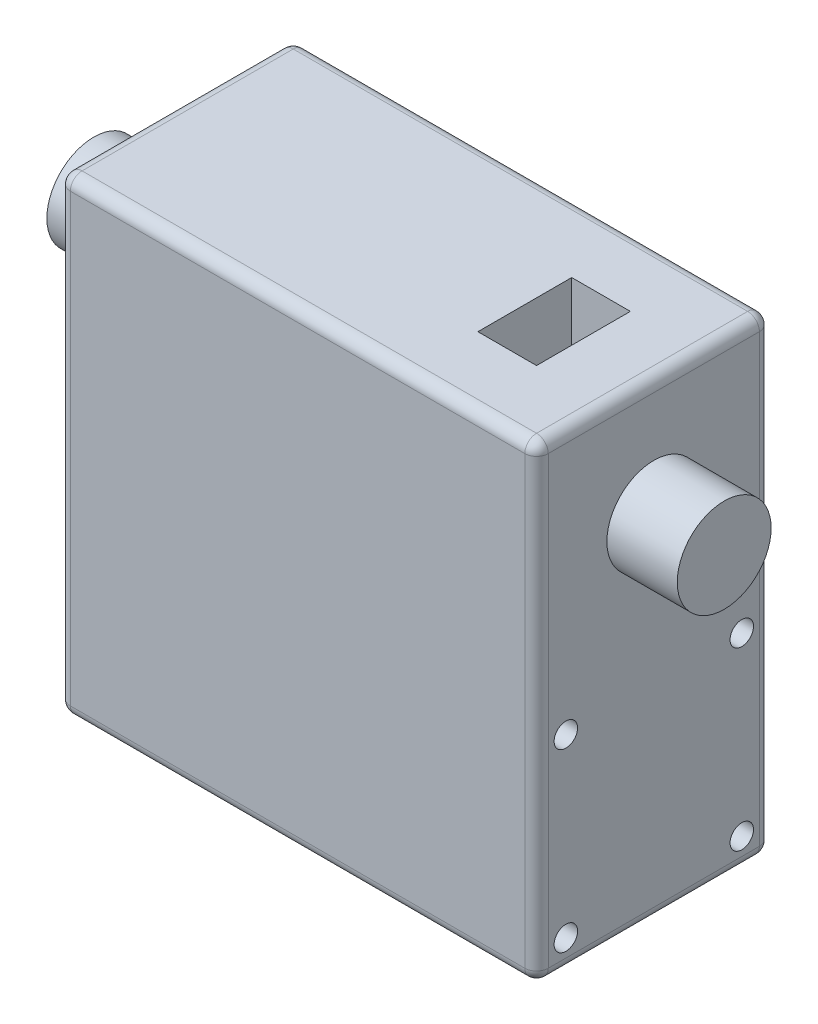
ISO-10303-21;
HEADER;
FILE_DESCRIPTION(('STEP AP214'),'2;1');
FILE_NAME('part.step','',(''),(''),'','','');
FILE_SCHEMA(('AUTOMOTIVE_DESIGN { 1 0 10303 214 1 1 1 1 }'));
ENDSEC;
DATA;
#1=APPLICATION_CONTEXT('core data for automotive mechanical design processes');
#2=APPLICATION_PROTOCOL_DEFINITION('international standard','automotive_design',2000,#1);
#3=PRODUCT_CONTEXT('',#1,'mechanical');
#4=PRODUCT('Part','Part','',(#3));
#5=PRODUCT_RELATED_PRODUCT_CATEGORY('part','',(#4));
#6=PRODUCT_DEFINITION_FORMATION('','',#4);
#7=PRODUCT_DEFINITION_CONTEXT('part definition',#1,'design');
#8=PRODUCT_DEFINITION('design','',#6,#7);
#9=PRODUCT_DEFINITION_SHAPE('','',#8);
#10=(LENGTH_UNIT() NAMED_UNIT(*) SI_UNIT(.MILLI.,.METRE.));
#11=(NAMED_UNIT(*) PLANE_ANGLE_UNIT() SI_UNIT($,.RADIAN.));
#12=(NAMED_UNIT(*) SI_UNIT($,.STERADIAN.) SOLID_ANGLE_UNIT());
#13=UNCERTAINTY_MEASURE_WITH_UNIT(LENGTH_MEASURE(1.E-05),#10,'distance_accuracy_value','');
#14=(GEOMETRIC_REPRESENTATION_CONTEXT(3) GLOBAL_UNCERTAINTY_ASSIGNED_CONTEXT((#13)) GLOBAL_UNIT_ASSIGNED_CONTEXT((#10,
#11,#12)) REPRESENTATION_CONTEXT('',''));
#15=CARTESIAN_POINT('',(0.,0.,0.));
#16=DIRECTION('',(0.,0.,1.));
#17=DIRECTION('',(1.,0.,0.));
#18=AXIS2_PLACEMENT_3D('',#15,#16,#17);
#19=CARTESIAN_POINT('',(0.,0.,20.));
#20=DIRECTION('',(1.,0.,0.));
#21=DIRECTION('',(0.,0.,-1.));
#22=AXIS2_PLACEMENT_3D('',#19,#20,#21);
#23=PLANE('',#22);
#24=CARTESIAN_POINT('',(0.,10.,17.));
#25=DIRECTION('',(-1.,0.,0.));
#26=DIRECTION('',(0.,0.,1.));
#27=AXIS2_PLACEMENT_3D('',#24,#25,#26);
#28=CIRCLE('',#27,1.);
#29=CARTESIAN_POINT('',(0.,10.,18.));
#30=VERTEX_POINT('',#29);
#31=EDGE_CURVE('E839',#30,#30,#28,.T.);
#32=ORIENTED_EDGE('',*,*,#31,.F.);
#33=EDGE_LOOP('',(#32));
#34=FACE_BOUND('',#33,.T.);
#35=CARTESIAN_POINT('',(0.,3.,10.));
#36=DIRECTION('',(-1.,0.,0.));
#37=DIRECTION('',(0.,0.,1.));
#38=AXIS2_PLACEMENT_3D('',#35,#36,#37);
#39=CIRCLE('',#38,1.);
#40=CARTESIAN_POINT('',(0.,3.,11.));
#41=VERTEX_POINT('',#40);
#42=EDGE_CURVE('E850',#41,#41,#39,.T.);
#43=ORIENTED_EDGE('',*,*,#42,.F.);
#44=EDGE_LOOP('',(#43));
#45=FACE_BOUND('',#44,.T.);
#46=CARTESIAN_POINT('',(0.,10.,3.));
#47=DIRECTION('',(-1.,0.,0.));
#48=DIRECTION('',(0.,0.,1.));
#49=AXIS2_PLACEMENT_3D('',#46,#47,#48);
#50=CIRCLE('',#49,1.);
#51=CARTESIAN_POINT('',(0.,10.,4.));
#52=VERTEX_POINT('',#51);
#53=EDGE_CURVE('E856',#52,#52,#50,.T.);
#54=ORIENTED_EDGE('',*,*,#53,.F.);
#55=EDGE_LOOP('',(#54));
#56=FACE_BOUND('',#55,.T.);
#57=CARTESIAN_POINT('',(0.,30.,10.));
#58=DIRECTION('',(1.,0.,0.));
#59=DIRECTION('',(0.,0.,-1.));
#60=AXIS2_PLACEMENT_3D('',#57,#58,#59);
#61=CIRCLE('',#60,4.);
#62=CARTESIAN_POINT('',(0.,30.,6.));
#63=VERTEX_POINT('',#62);
#64=EDGE_CURVE('E11',#63,#63,#61,.F.);
#65=ORIENTED_EDGE('',*,*,#64,.F.);
#66=EDGE_LOOP('',(#65));
#67=FACE_BOUND('',#66,.T.);
#68=DIRECTION('',(0.,0.,-1.));
#69=VECTOR('',#68,1.);
#70=CARTESIAN_POINT('',(0.,39.,20.));
#71=LINE('',#70,#69);
#72=CARTESIAN_POINT('',(0.,39.,19.));
#73=VERTEX_POINT('',#72);
#74=CARTESIAN_POINT('',(0.,39.,1.));
#75=VERTEX_POINT('',#74);
#76=EDGE_CURVE('E221',#73,#75,#71,.T.);
#77=ORIENTED_EDGE('',*,*,#76,.T.);
#78=DIRECTION('',(0.,-1.,0.));
#79=VECTOR('',#78,1.);
#80=CARTESIAN_POINT('',(0.,0.,1.));
#81=LINE('',#80,#79);
#82=CARTESIAN_POINT('',(0.,1.,1.));
#83=VERTEX_POINT('',#82);
#84=EDGE_CURVE('E226',#75,#83,#81,.T.);
#85=ORIENTED_EDGE('',*,*,#84,.T.);
#86=DIRECTION('',(0.,0.,-1.));
#87=VECTOR('',#86,1.);
#88=CARTESIAN_POINT('',(0.,1.,20.));
#89=LINE('',#88,#87);
#90=CARTESIAN_POINT('',(0.,1.,19.));
#91=VERTEX_POINT('',#90);
#92=EDGE_CURVE('E223',#83,#91,#89,.F.);
#93=ORIENTED_EDGE('',*,*,#92,.T.);
#94=DIRECTION('',(0.,-1.,0.));
#95=VECTOR('',#94,1.);
#96=CARTESIAN_POINT('',(0.,0.,19.));
#97=LINE('',#96,#95);
#98=EDGE_CURVE('E219',#91,#73,#97,.F.);
#99=ORIENTED_EDGE('',*,*,#98,.T.);
#100=EDGE_LOOP('',(#77,#85,#93,#99));
#101=FACE_BOUND('',#100,.T.);
#102=ADVANCED_FACE('F32',(#34,#45,#56,#67,#101),#23,.F.);
#103=CARTESIAN_POINT('',(0.,0.,20.));
#104=DIRECTION('',(0.,1.,0.));
#105=DIRECTION('',(0.,0.,1.));
#106=AXIS2_PLACEMENT_3D('',#103,#104,#105);
#107=PLANE('',#106);
#108=DIRECTION('',(0.,0.,-1.));
#109=VECTOR('',#108,1.);
#110=CARTESIAN_POINT('',(1.,0.,20.));
#111=LINE('',#110,#109);
#112=CARTESIAN_POINT('',(1.,0.,19.));
#113=VERTEX_POINT('',#112);
#114=CARTESIAN_POINT('',(1.,0.,1.));
#115=VERTEX_POINT('',#114);
#116=EDGE_CURVE('E203',#113,#115,#111,.T.);
#117=ORIENTED_EDGE('',*,*,#116,.T.);
#118=DIRECTION('',(1.,0.,0.));
#119=VECTOR('',#118,1.);
#120=CARTESIAN_POINT('',(40.745918,0.,1.));
#121=LINE('',#120,#119);
#122=CARTESIAN_POINT('',(39.745918,0.,1.));
#123=VERTEX_POINT('',#122);
#124=EDGE_CURVE('E208',#115,#123,#121,.T.);
#125=ORIENTED_EDGE('',*,*,#124,.T.);
#126=DIRECTION('',(0.,0.,-1.));
#127=VECTOR('',#126,1.);
#128=CARTESIAN_POINT('',(39.745918,0.,20.));
#129=LINE('',#128,#127);
#130=CARTESIAN_POINT('',(39.745918,0.,19.));
#131=VERTEX_POINT('',#130);
#132=EDGE_CURVE('E205',#123,#131,#129,.F.);
#133=ORIENTED_EDGE('',*,*,#132,.T.);
#134=DIRECTION('',(1.,0.,0.));
#135=VECTOR('',#134,1.);
#136=CARTESIAN_POINT('',(0.,0.,19.));
#137=LINE('',#136,#135);
#138=EDGE_CURVE('E201',#131,#113,#137,.F.);
#139=ORIENTED_EDGE('',*,*,#138,.T.);
#140=EDGE_LOOP('',(#117,#125,#133,#139));
#141=FACE_BOUND('',#140,.T.);
#142=ADVANCED_FACE('F316',(#141),#107,.F.);
#143=CARTESIAN_POINT('',(40.745918,0.,20.));
#144=DIRECTION('',(-1.,0.,0.));
#145=DIRECTION('',(0.,0.,1.));
#146=AXIS2_PLACEMENT_3D('',#143,#144,#145);
#147=PLANE('',#146);
#148=CARTESIAN_POINT('',(40.745918,2.5,17.5));
#149=DIRECTION('',(1.,0.,0.));
#150=DIRECTION('',(0.,0.,-1.));
#151=AXIS2_PLACEMENT_3D('',#148,#149,#150);
#152=CIRCLE('',#151,1.);
#153=CARTESIAN_POINT('',(40.745918,2.5,16.5));
#154=VERTEX_POINT('',#153);
#155=EDGE_CURVE('E838',#154,#154,#152,.T.);
#156=ORIENTED_EDGE('',*,*,#155,.F.);
#157=EDGE_LOOP('',(#156));
#158=FACE_BOUND('',#157,.T.);
#159=CARTESIAN_POINT('',(40.745918,2.5,2.5));
#160=DIRECTION('',(1.,0.,0.));
#161=DIRECTION('',(0.,0.,-1.));
#162=AXIS2_PLACEMENT_3D('',#159,#160,#161);
#163=CIRCLE('',#162,1.);
#164=CARTESIAN_POINT('',(40.745918,2.5,1.5));
#165=VERTEX_POINT('',#164);
#166=EDGE_CURVE('E869',#165,#165,#163,.T.);
#167=ORIENTED_EDGE('',*,*,#166,.F.);
#168=EDGE_LOOP('',(#167));
#169=FACE_BOUND('',#168,.T.);
#170=CARTESIAN_POINT('',(40.745918,17.5,2.5));
#171=DIRECTION('',(1.,0.,0.));
#172=DIRECTION('',(0.,0.,-1.));
#173=AXIS2_PLACEMENT_3D('',#170,#171,#172);
#174=CIRCLE('',#173,1.);
#175=CARTESIAN_POINT('',(40.745918,17.5,1.5));
#176=VERTEX_POINT('',#175);
#177=EDGE_CURVE('E863',#176,#176,#174,.T.);
#178=ORIENTED_EDGE('',*,*,#177,.F.);
#179=EDGE_LOOP('',(#178));
#180=FACE_BOUND('',#179,.T.);
#181=CARTESIAN_POINT('',(40.745918,17.5,17.5));
#182=DIRECTION('',(1.,0.,0.));
#183=DIRECTION('',(0.,0.,-1.));
#184=AXIS2_PLACEMENT_3D('',#181,#182,#183);
#185=CIRCLE('',#184,1.);
#186=CARTESIAN_POINT('',(40.745918,17.5,16.5));
#187=VERTEX_POINT('',#186);
#188=EDGE_CURVE('E862',#187,#187,#185,.T.);
#189=ORIENTED_EDGE('',*,*,#188,.F.);
#190=EDGE_LOOP('',(#189));
#191=FACE_BOUND('',#190,.T.);
#192=CARTESIAN_POINT('',(40.745918,30.,10.));
#193=DIRECTION('',(-1.,0.,0.));
#194=DIRECTION('',(0.,0.,1.));
#195=AXIS2_PLACEMENT_3D('',#192,#193,#194);
#196=CIRCLE('',#195,4.);
#197=CARTESIAN_POINT('',(40.745918,30.,14.));
#198=VERTEX_POINT('',#197);
#199=EDGE_CURVE('E40',#198,#198,#196,.F.);
#200=ORIENTED_EDGE('',*,*,#199,.F.);
#201=EDGE_LOOP('',(#200));
#202=FACE_BOUND('',#201,.T.);
#203=DIRECTION('',(0.,0.,-1.));
#204=VECTOR('',#203,1.);
#205=CARTESIAN_POINT('',(40.745918,1.,20.));
#206=LINE('',#205,#204);
#207=CARTESIAN_POINT('',(40.745918,1.,19.));
#208=VERTEX_POINT('',#207);
#209=CARTESIAN_POINT('',(40.745918,1.,1.));
#210=VERTEX_POINT('',#209);
#211=EDGE_CURVE('E196',#208,#210,#206,.T.);
#212=ORIENTED_EDGE('',*,*,#211,.T.);
#213=DIRECTION('',(0.,1.,0.));
#214=VECTOR('',#213,1.);
#215=CARTESIAN_POINT('',(40.745918,40.,1.));
#216=LINE('',#215,#214);
#217=CARTESIAN_POINT('',(40.745918,39.,1.));
#218=VERTEX_POINT('',#217);
#219=EDGE_CURVE('E199',#210,#218,#216,.T.);
#220=ORIENTED_EDGE('',*,*,#219,.T.);
#221=DIRECTION('',(0.,0.,-1.));
#222=VECTOR('',#221,1.);
#223=CARTESIAN_POINT('',(40.745918,39.,20.));
#224=LINE('',#223,#222);
#225=CARTESIAN_POINT('',(40.745918,39.,19.));
#226=VERTEX_POINT('',#225);
#227=EDGE_CURVE('E193',#218,#226,#224,.F.);
#228=ORIENTED_EDGE('',*,*,#227,.T.);
#229=DIRECTION('',(0.,1.,0.));
#230=VECTOR('',#229,1.);
#231=CARTESIAN_POINT('',(40.745918,0.,19.));
#232=LINE('',#231,#230);
#233=EDGE_CURVE('E191',#226,#208,#232,.F.);
#234=ORIENTED_EDGE('',*,*,#233,.T.);
#235=EDGE_LOOP('',(#212,#220,#228,#234));
#236=FACE_BOUND('',#235,.T.);
#237=ADVANCED_FACE('F312',(#158,#169,#180,#191,#202,#236),#147,.F.);
#238=CARTESIAN_POINT('',(0.,40.,20.));
#239=DIRECTION('',(0.,-1.,0.));
#240=DIRECTION('',(0.,0.,-1.));
#241=AXIS2_PLACEMENT_3D('',#238,#239,#240);
#242=PLANE('',#241);
#243=DIRECTION('',(1.,0.,0.));
#244=VECTOR('',#243,1.);
#245=CARTESIAN_POINT('',(29.745918,40.,14.));
#246=LINE('',#245,#244);
#247=CARTESIAN_POINT('',(29.745918,40.,14.));
#248=VERTEX_POINT('',#247);
#249=CARTESIAN_POINT('',(34.745918,40.,14.));
#250=VERTEX_POINT('',#249);
#251=EDGE_CURVE('E178',#248,#250,#246,.T.);
#252=ORIENTED_EDGE('',*,*,#251,.F.);
#253=DIRECTION('',(0.,0.,1.));
#254=VECTOR('',#253,1.);
#255=CARTESIAN_POINT('',(29.745918,40.,6.));
#256=LINE('',#255,#254);
#257=CARTESIAN_POINT('',(29.745918,40.,6.));
#258=VERTEX_POINT('',#257);
#259=EDGE_CURVE('E47',#258,#248,#256,.T.);
#260=ORIENTED_EDGE('',*,*,#259,.F.);
#261=DIRECTION('',(-1.,0.,0.));
#262=VECTOR('',#261,1.);
#263=CARTESIAN_POINT('',(29.745918,40.,6.));
#264=LINE('',#263,#262);
#265=CARTESIAN_POINT('',(34.745918,40.,6.));
#266=VERTEX_POINT('',#265);
#267=EDGE_CURVE('E166',#266,#258,#264,.T.);
#268=ORIENTED_EDGE('',*,*,#267,.F.);
#269=DIRECTION('',(0.,0.,-1.));
#270=VECTOR('',#269,1.);
#271=CARTESIAN_POINT('',(34.745918,40.,6.));
#272=LINE('',#271,#270);
#273=EDGE_CURVE('E169',#250,#266,#272,.T.);
#274=ORIENTED_EDGE('',*,*,#273,.F.);
#275=EDGE_LOOP('',(#252,#260,#268,#274));
#276=FACE_BOUND('',#275,.T.);
#277=DIRECTION('',(0.,0.,-1.));
#278=VECTOR('',#277,1.);
#279=CARTESIAN_POINT('',(39.745918,40.,20.));
#280=LINE('',#279,#278);
#281=CARTESIAN_POINT('',(39.745918,40.,19.));
#282=VERTEX_POINT('',#281);
#283=CARTESIAN_POINT('',(39.745918,40.,1.));
#284=VERTEX_POINT('',#283);
#285=EDGE_CURVE('E214',#282,#284,#280,.T.);
#286=ORIENTED_EDGE('',*,*,#285,.T.);
#287=DIRECTION('',(-1.,0.,0.));
#288=VECTOR('',#287,1.);
#289=CARTESIAN_POINT('',(0.,40.,1.));
#290=LINE('',#289,#288);
#291=CARTESIAN_POINT('',(1.,40.,1.));
#292=VERTEX_POINT('',#291);
#293=EDGE_CURVE('E217',#284,#292,#290,.T.);
#294=ORIENTED_EDGE('',*,*,#293,.T.);
#295=DIRECTION('',(0.,0.,-1.));
#296=VECTOR('',#295,1.);
#297=CARTESIAN_POINT('',(1.,40.,20.));
#298=LINE('',#297,#296);
#299=CARTESIAN_POINT('',(1.,40.,19.));
#300=VERTEX_POINT('',#299);
#301=EDGE_CURVE('E212',#292,#300,#298,.F.);
#302=ORIENTED_EDGE('',*,*,#301,.T.);
#303=DIRECTION('',(-1.,0.,0.));
#304=VECTOR('',#303,1.);
#305=CARTESIAN_POINT('',(0.,40.,19.));
#306=LINE('',#305,#304);
#307=EDGE_CURVE('E210',#300,#282,#306,.F.);
#308=ORIENTED_EDGE('',*,*,#307,.T.);
#309=EDGE_LOOP('',(#286,#294,#302,#308));
#310=FACE_BOUND('',#309,.T.);
#311=ADVANCED_FACE('F315',(#276,#310),#242,.F.);
#312=CARTESIAN_POINT('',(0.,0.,20.));
#313=DIRECTION('',(0.,0.,-1.));
#314=DIRECTION('',(-1.,0.,0.));
#315=AXIS2_PLACEMENT_3D('',#312,#313,#314);
#316=PLANE('',#315);
#317=DIRECTION('',(-1.,0.,0.));
#318=VECTOR('',#317,1.);
#319=CARTESIAN_POINT('',(0.,39.,20.));
#320=LINE('',#319,#318);
#321=CARTESIAN_POINT('',(39.745918,39.,20.));
#322=VERTEX_POINT('',#321);
#323=CARTESIAN_POINT('',(1.,39.,20.));
#324=VERTEX_POINT('',#323);
#325=EDGE_CURVE('E239',#322,#324,#320,.T.);
#326=ORIENTED_EDGE('',*,*,#325,.T.);
#327=DIRECTION('',(0.,-1.,0.));
#328=VECTOR('',#327,1.);
#329=CARTESIAN_POINT('',(1.,0.,20.));
#330=LINE('',#329,#328);
#331=CARTESIAN_POINT('',(1.,1.,20.));
#332=VERTEX_POINT('',#331);
#333=EDGE_CURVE('E55',#324,#332,#330,.T.);
#334=ORIENTED_EDGE('',*,*,#333,.T.);
#335=DIRECTION('',(1.,0.,0.));
#336=VECTOR('',#335,1.);
#337=CARTESIAN_POINT('',(0.,1.,20.));
#338=LINE('',#337,#336);
#339=CARTESIAN_POINT('',(39.745918,1.,20.));
#340=VERTEX_POINT('',#339);
#341=EDGE_CURVE('E241',#332,#340,#338,.T.);
#342=ORIENTED_EDGE('',*,*,#341,.T.);
#343=DIRECTION('',(0.,1.,0.));
#344=VECTOR('',#343,1.);
#345=CARTESIAN_POINT('',(39.745918,0.,20.));
#346=LINE('',#345,#344);
#347=EDGE_CURVE('E237',#340,#322,#346,.T.);
#348=ORIENTED_EDGE('',*,*,#347,.T.);
#349=EDGE_LOOP('',(#326,#334,#342,#348));
#350=FACE_BOUND('',#349,.T.);
#351=ADVANCED_FACE('F403',(#350),#316,.F.);
#352=CARTESIAN_POINT('',(0.,0.,0.));
#353=DIRECTION('',(0.,0.,-1.));
#354=DIRECTION('',(-1.,0.,0.));
#355=AXIS2_PLACEMENT_3D('',#352,#353,#354);
#356=PLANE('',#355);
#357=DIRECTION('',(1.,0.,0.));
#358=VECTOR('',#357,1.);
#359=CARTESIAN_POINT('',(0.,1.,0.));
#360=LINE('',#359,#358);
#361=CARTESIAN_POINT('',(39.745918,1.,0.));
#362=VERTEX_POINT('',#361);
#363=CARTESIAN_POINT('',(1.,1.,0.));
#364=VERTEX_POINT('',#363);
#365=EDGE_CURVE('E232',#362,#364,#360,.F.);
#366=ORIENTED_EDGE('',*,*,#365,.T.);
#367=DIRECTION('',(0.,-1.,0.));
#368=VECTOR('',#367,1.);
#369=CARTESIAN_POINT('',(1.,40.,0.));
#370=LINE('',#369,#368);
#371=CARTESIAN_POINT('',(1.,39.,0.));
#372=VERTEX_POINT('',#371);
#373=EDGE_CURVE('E235',#364,#372,#370,.F.);
#374=ORIENTED_EDGE('',*,*,#373,.T.);
#375=DIRECTION('',(-1.,0.,0.));
#376=VECTOR('',#375,1.);
#377=CARTESIAN_POINT('',(40.745918,39.,0.));
#378=LINE('',#377,#376);
#379=CARTESIAN_POINT('',(39.745918,39.,0.));
#380=VERTEX_POINT('',#379);
#381=EDGE_CURVE('E230',#372,#380,#378,.F.);
#382=ORIENTED_EDGE('',*,*,#381,.T.);
#383=DIRECTION('',(0.,1.,0.));
#384=VECTOR('',#383,1.);
#385=CARTESIAN_POINT('',(39.745918,0.,0.));
#386=LINE('',#385,#384);
#387=EDGE_CURVE('E228',#380,#362,#386,.F.);
#388=ORIENTED_EDGE('',*,*,#387,.T.);
#389=EDGE_LOOP('',(#366,#374,#382,#388));
#390=FACE_BOUND('',#389,.T.);
#391=ADVANCED_FACE('F383',(#390),#356,.T.);
#392=CARTESIAN_POINT('',(1.,39.,20.));
#393=DIRECTION('',(0.,0.,-1.));
#394=DIRECTION('',(-1.,0.,0.));
#395=AXIS2_PLACEMENT_3D('',#392,#393,#394);
#396=CYLINDRICAL_SURFACE('',#395,1.);
#397=CARTESIAN_POINT('',(1.,39.,19.));
#398=DIRECTION('',(0.,0.,1.));
#399=DIRECTION('',(1.,0.,0.));
#400=AXIS2_PLACEMENT_3D('',#397,#398,#399);
#401=CIRCLE('',#400,1.);
#402=EDGE_CURVE('E194',#300,#73,#401,.T.);
#403=ORIENTED_EDGE('',*,*,#402,.F.);
#404=ORIENTED_EDGE('',*,*,#301,.F.);
#405=CARTESIAN_POINT('',(1.,39.,1.));
#406=DIRECTION('',(0.,0.,-1.));
#407=DIRECTION('',(-1.,0.,0.));
#408=AXIS2_PLACEMENT_3D('',#405,#406,#407);
#409=CIRCLE('',#408,1.);
#410=EDGE_CURVE('E303',#75,#292,#409,.T.);
#411=ORIENTED_EDGE('',*,*,#410,.F.);
#412=ORIENTED_EDGE('',*,*,#76,.F.);
#413=EDGE_LOOP('',(#403,#404,#411,#412));
#414=FACE_BOUND('',#413,.T.);
#415=ADVANCED_FACE('F34',(#414),#396,.T.);
#416=CARTESIAN_POINT('',(1.,39.,19.));
#417=DIRECTION('',(0.,0.,1.));
#418=DIRECTION('',(1.,0.,0.));
#419=AXIS2_PLACEMENT_3D('',#416,#417,#418);
#420=SPHERICAL_SURFACE('',#419,1.);
#421=CARTESIAN_POINT('',(1.,39.,19.));
#422=DIRECTION('',(-1.,0.,0.));
#423=DIRECTION('',(0.,0.,1.));
#424=AXIS2_PLACEMENT_3D('',#421,#422,#423);
#425=CIRCLE('',#424,1.);
#426=EDGE_CURVE('E297',#300,#324,#425,.F.);
#427=ORIENTED_EDGE('',*,*,#426,.F.);
#428=ORIENTED_EDGE('',*,*,#402,.T.);
#429=CARTESIAN_POINT('',(1.,39.,19.));
#430=DIRECTION('',(0.,1.,0.));
#431=DIRECTION('',(0.,0.,1.));
#432=AXIS2_PLACEMENT_3D('',#429,#430,#431);
#433=CIRCLE('',#432,1.);
#434=EDGE_CURVE('E300',#324,#73,#433,.F.);
#435=ORIENTED_EDGE('',*,*,#434,.F.);
#436=EDGE_LOOP('',(#427,#428,#435));
#437=FACE_BOUND('',#436,.T.);
#438=ADVANCED_FACE('F396',(#437),#420,.T.);
#439=CARTESIAN_POINT('',(1.,39.,1.));
#440=DIRECTION('',(0.,0.,1.));
#441=DIRECTION('',(1.,0.,0.));
#442=AXIS2_PLACEMENT_3D('',#439,#440,#441);
#443=SPHERICAL_SURFACE('',#442,1.);
#444=CARTESIAN_POINT('',(1.,39.,1.));
#445=DIRECTION('',(0.,1.,0.));
#446=DIRECTION('',(0.,0.,1.));
#447=AXIS2_PLACEMENT_3D('',#444,#445,#446);
#448=CIRCLE('',#447,1.);
#449=EDGE_CURVE('E291',#75,#372,#448,.F.);
#450=ORIENTED_EDGE('',*,*,#449,.F.);
#451=ORIENTED_EDGE('',*,*,#410,.T.);
#452=CARTESIAN_POINT('',(1.,39.,1.));
#453=DIRECTION('',(-1.,0.,0.));
#454=DIRECTION('',(0.,0.,1.));
#455=AXIS2_PLACEMENT_3D('',#452,#453,#454);
#456=CIRCLE('',#455,1.);
#457=EDGE_CURVE('E294',#372,#292,#456,.F.);
#458=ORIENTED_EDGE('',*,*,#457,.F.);
#459=EDGE_LOOP('',(#450,#451,#458));
#460=FACE_BOUND('',#459,.T.);
#461=ADVANCED_FACE('F391',(#460),#443,.T.);
#462=CARTESIAN_POINT('',(1.,0.,19.));
#463=DIRECTION('',(0.,-1.,0.));
#464=DIRECTION('',(0.,0.,-1.));
#465=AXIS2_PLACEMENT_3D('',#462,#463,#464);
#466=CYLINDRICAL_SURFACE('',#465,1.);
#467=ORIENTED_EDGE('',*,*,#434,.T.);
#468=ORIENTED_EDGE('',*,*,#98,.F.);
#469=CARTESIAN_POINT('',(1.,1.,19.));
#470=DIRECTION('',(0.,-1.,0.));
#471=DIRECTION('',(0.,0.,-1.));
#472=AXIS2_PLACEMENT_3D('',#469,#470,#471);
#473=CIRCLE('',#472,1.);
#474=EDGE_CURVE('E286',#332,#91,#473,.T.);
#475=ORIENTED_EDGE('',*,*,#474,.F.);
#476=ORIENTED_EDGE('',*,*,#333,.F.);
#477=EDGE_LOOP('',(#467,#468,#475,#476));
#478=FACE_BOUND('',#477,.T.);
#479=ADVANCED_FACE('F399',(#478),#466,.T.);
#480=CARTESIAN_POINT('',(0.,39.,19.));
#481=DIRECTION('',(-1.,0.,0.));
#482=DIRECTION('',(0.,0.,1.));
#483=AXIS2_PLACEMENT_3D('',#480,#481,#482);
#484=CYLINDRICAL_SURFACE('',#483,1.);
#485=ORIENTED_EDGE('',*,*,#426,.T.);
#486=ORIENTED_EDGE('',*,*,#325,.F.);
#487=CARTESIAN_POINT('',(39.745918,39.,19.));
#488=DIRECTION('',(1.,0.,0.));
#489=DIRECTION('',(0.,0.,-1.));
#490=AXIS2_PLACEMENT_3D('',#487,#488,#489);
#491=CIRCLE('',#490,1.);
#492=EDGE_CURVE('E283',#282,#322,#491,.T.);
#493=ORIENTED_EDGE('',*,*,#492,.F.);
#494=ORIENTED_EDGE('',*,*,#307,.F.);
#495=EDGE_LOOP('',(#485,#486,#493,#494));
#496=FACE_BOUND('',#495,.T.);
#497=ADVANCED_FACE('F356',(#496),#484,.T.);
#498=CARTESIAN_POINT('',(39.745918,39.,20.));
#499=DIRECTION('',(0.,0.,-1.));
#500=DIRECTION('',(-1.,0.,0.));
#501=AXIS2_PLACEMENT_3D('',#498,#499,#500);
#502=CYLINDRICAL_SURFACE('',#501,1.);
#503=CARTESIAN_POINT('',(39.745918,39.,1.));
#504=DIRECTION('',(0.,0.,-1.));
#505=DIRECTION('',(-1.,0.,0.));
#506=AXIS2_PLACEMENT_3D('',#503,#504,#505);
#507=CIRCLE('',#506,1.);
#508=EDGE_CURVE('E277',#284,#218,#507,.T.);
#509=ORIENTED_EDGE('',*,*,#508,.F.);
#510=ORIENTED_EDGE('',*,*,#285,.F.);
#511=CARTESIAN_POINT('',(39.745918,39.,19.));
#512=DIRECTION('',(0.,0.,1.));
#513=DIRECTION('',(1.,0.,0.));
#514=AXIS2_PLACEMENT_3D('',#511,#512,#513);
#515=CIRCLE('',#514,1.);
#516=EDGE_CURVE('E280',#226,#282,#515,.T.);
#517=ORIENTED_EDGE('',*,*,#516,.F.);
#518=ORIENTED_EDGE('',*,*,#227,.F.);
#519=EDGE_LOOP('',(#509,#510,#517,#518));
#520=FACE_BOUND('',#519,.T.);
#521=ADVANCED_FACE('F344',(#520),#502,.T.);
#522=CARTESIAN_POINT('',(0.,39.,1.));
#523=DIRECTION('',(1.,0.,0.));
#524=DIRECTION('',(0.,0.,-1.));
#525=AXIS2_PLACEMENT_3D('',#522,#523,#524);
#526=CYLINDRICAL_SURFACE('',#525,1.);
#527=ORIENTED_EDGE('',*,*,#457,.T.);
#528=ORIENTED_EDGE('',*,*,#293,.F.);
#529=CARTESIAN_POINT('',(39.745918,39.,1.));
#530=DIRECTION('',(1.,0.,0.));
#531=DIRECTION('',(0.,0.,-1.));
#532=AXIS2_PLACEMENT_3D('',#529,#530,#531);
#533=CIRCLE('',#532,1.);
#534=EDGE_CURVE('E275',#380,#284,#533,.T.);
#535=ORIENTED_EDGE('',*,*,#534,.F.);
#536=ORIENTED_EDGE('',*,*,#381,.F.);
#537=EDGE_LOOP('',(#527,#528,#535,#536));
#538=FACE_BOUND('',#537,.T.);
#539=ADVANCED_FACE('F348',(#538),#526,.T.);
#540=CARTESIAN_POINT('',(1.,0.,1.));
#541=DIRECTION('',(0.,1.,0.));
#542=DIRECTION('',(0.,0.,1.));
#543=AXIS2_PLACEMENT_3D('',#540,#541,#542);
#544=CYLINDRICAL_SURFACE('',#543,1.);
#545=ORIENTED_EDGE('',*,*,#449,.T.);
#546=ORIENTED_EDGE('',*,*,#373,.F.);
#547=CARTESIAN_POINT('',(1.,1.,1.));
#548=DIRECTION('',(0.,-1.,0.));
#549=DIRECTION('',(0.,0.,-1.));
#550=AXIS2_PLACEMENT_3D('',#547,#548,#549);
#551=CIRCLE('',#550,1.);
#552=EDGE_CURVE('E272',#83,#364,#551,.T.);
#553=ORIENTED_EDGE('',*,*,#552,.F.);
#554=ORIENTED_EDGE('',*,*,#84,.F.);
#555=EDGE_LOOP('',(#545,#546,#553,#554));
#556=FACE_BOUND('',#555,.T.);
#557=ADVANCED_FACE('F389',(#556),#544,.T.);
#558=CARTESIAN_POINT('',(1.,1.,20.));
#559=DIRECTION('',(0.,0.,-1.));
#560=DIRECTION('',(-1.,0.,0.));
#561=AXIS2_PLACEMENT_3D('',#558,#559,#560);
#562=CYLINDRICAL_SURFACE('',#561,1.);
#563=CARTESIAN_POINT('',(1.,1.,19.));
#564=DIRECTION('',(0.,0.,1.));
#565=DIRECTION('',(1.,0.,0.));
#566=AXIS2_PLACEMENT_3D('',#563,#564,#565);
#567=CIRCLE('',#566,1.);
#568=EDGE_CURVE('E288',#91,#113,#567,.T.);
#569=ORIENTED_EDGE('',*,*,#568,.F.);
#570=ORIENTED_EDGE('',*,*,#92,.F.);
#571=CARTESIAN_POINT('',(1.,1.,1.));
#572=DIRECTION('',(0.,0.,-1.));
#573=DIRECTION('',(-1.,0.,0.));
#574=AXIS2_PLACEMENT_3D('',#571,#572,#573);
#575=CIRCLE('',#574,1.);
#576=EDGE_CURVE('E269',#115,#83,#575,.T.);
#577=ORIENTED_EDGE('',*,*,#576,.F.);
#578=ORIENTED_EDGE('',*,*,#116,.F.);
#579=EDGE_LOOP('',(#569,#570,#577,#578));
#580=FACE_BOUND('',#579,.T.);
#581=ADVANCED_FACE('F448',(#580),#562,.T.);
#582=CARTESIAN_POINT('',(1.,1.,19.));
#583=DIRECTION('',(0.,0.,1.));
#584=DIRECTION('',(1.,0.,0.));
#585=AXIS2_PLACEMENT_3D('',#582,#583,#584);
#586=SPHERICAL_SURFACE('',#585,1.);
#587=ORIENTED_EDGE('',*,*,#474,.T.);
#588=ORIENTED_EDGE('',*,*,#568,.T.);
#589=CARTESIAN_POINT('',(1.,1.,19.));
#590=DIRECTION('',(-1.,0.,0.));
#591=DIRECTION('',(0.,0.,1.));
#592=AXIS2_PLACEMENT_3D('',#589,#590,#591);
#593=CIRCLE('',#592,1.);
#594=EDGE_CURVE('E266',#332,#113,#593,.F.);
#595=ORIENTED_EDGE('',*,*,#594,.F.);
#596=EDGE_LOOP('',(#587,#588,#595));
#597=FACE_BOUND('',#596,.T.);
#598=ADVANCED_FACE('F402',(#597),#586,.T.);
#599=CARTESIAN_POINT('',(39.745918,39.,19.));
#600=DIRECTION('',(0.,0.,1.));
#601=DIRECTION('',(1.,0.,0.));
#602=AXIS2_PLACEMENT_3D('',#599,#600,#601);
#603=SPHERICAL_SURFACE('',#602,1.);
#604=ORIENTED_EDGE('',*,*,#516,.T.);
#605=ORIENTED_EDGE('',*,*,#492,.T.);
#606=CARTESIAN_POINT('',(39.745918,39.,19.));
#607=DIRECTION('',(0.,1.,0.));
#608=DIRECTION('',(0.,0.,1.));
#609=AXIS2_PLACEMENT_3D('',#606,#607,#608);
#610=CIRCLE('',#609,1.);
#611=EDGE_CURVE('E263',#226,#322,#610,.F.);
#612=ORIENTED_EDGE('',*,*,#611,.F.);
#613=EDGE_LOOP('',(#604,#605,#612));
#614=FACE_BOUND('',#613,.T.);
#615=ADVANCED_FACE('F362',(#614),#603,.T.);
#616=CARTESIAN_POINT('',(39.745918,39.,1.));
#617=DIRECTION('',(0.,0.,1.));
#618=DIRECTION('',(1.,0.,0.));
#619=AXIS2_PLACEMENT_3D('',#616,#617,#618);
#620=SPHERICAL_SURFACE('',#619,1.);
#621=ORIENTED_EDGE('',*,*,#534,.T.);
#622=ORIENTED_EDGE('',*,*,#508,.T.);
#623=CARTESIAN_POINT('',(39.745918,39.,1.));
#624=DIRECTION('',(0.,1.,0.));
#625=DIRECTION('',(0.,0.,1.));
#626=AXIS2_PLACEMENT_3D('',#623,#624,#625);
#627=CIRCLE('',#626,1.);
#628=EDGE_CURVE('E260',#380,#218,#627,.F.);
#629=ORIENTED_EDGE('',*,*,#628,.F.);
#630=EDGE_LOOP('',(#621,#622,#629));
#631=FACE_BOUND('',#630,.T.);
#632=ADVANCED_FACE('F338',(#631),#620,.T.);
#633=CARTESIAN_POINT('',(1.,1.,1.));
#634=DIRECTION('',(0.,0.,1.));
#635=DIRECTION('',(1.,0.,0.));
#636=AXIS2_PLACEMENT_3D('',#633,#634,#635);
#637=SPHERICAL_SURFACE('',#636,1.);
#638=ORIENTED_EDGE('',*,*,#576,.T.);
#639=ORIENTED_EDGE('',*,*,#552,.T.);
#640=CARTESIAN_POINT('',(1.,1.,1.));
#641=DIRECTION('',(-1.,0.,0.));
#642=DIRECTION('',(0.,0.,1.));
#643=AXIS2_PLACEMENT_3D('',#640,#641,#642);
#644=CIRCLE('',#643,1.);
#645=EDGE_CURVE('E258',#115,#364,#644,.F.);
#646=ORIENTED_EDGE('',*,*,#645,.F.);
#647=EDGE_LOOP('',(#638,#639,#646));
#648=FACE_BOUND('',#647,.T.);
#649=ADVANCED_FACE('F438',(#648),#637,.T.);
#650=CARTESIAN_POINT('',(0.,1.,19.));
#651=DIRECTION('',(1.,0.,0.));
#652=DIRECTION('',(0.,0.,-1.));
#653=AXIS2_PLACEMENT_3D('',#650,#651,#652);
#654=CYLINDRICAL_SURFACE('',#653,1.);
#655=ORIENTED_EDGE('',*,*,#594,.T.);
#656=ORIENTED_EDGE('',*,*,#138,.F.);
#657=CARTESIAN_POINT('',(39.745918,1.,19.));
#658=DIRECTION('',(1.,0.,0.));
#659=DIRECTION('',(0.,0.,-1.));
#660=AXIS2_PLACEMENT_3D('',#657,#658,#659);
#661=CIRCLE('',#660,1.);
#662=EDGE_CURVE('E255',#340,#131,#661,.T.);
#663=ORIENTED_EDGE('',*,*,#662,.F.);
#664=ORIENTED_EDGE('',*,*,#341,.F.);
#665=EDGE_LOOP('',(#655,#656,#663,#664));
#666=FACE_BOUND('',#665,.T.);
#667=ADVANCED_FACE('F372',(#666),#654,.T.);
#668=CARTESIAN_POINT('',(39.745918,0.,19.));
#669=DIRECTION('',(0.,1.,0.));
#670=DIRECTION('',(0.,0.,1.));
#671=AXIS2_PLACEMENT_3D('',#668,#669,#670);
#672=CYLINDRICAL_SURFACE('',#671,1.);
#673=ORIENTED_EDGE('',*,*,#611,.T.);
#674=ORIENTED_EDGE('',*,*,#347,.F.);
#675=CARTESIAN_POINT('',(39.745918,1.,19.));
#676=DIRECTION('',(0.,-1.,0.));
#677=DIRECTION('',(0.,0.,-1.));
#678=AXIS2_PLACEMENT_3D('',#675,#676,#677);
#679=CIRCLE('',#678,1.);
#680=EDGE_CURVE('E253',#208,#340,#679,.T.);
#681=ORIENTED_EDGE('',*,*,#680,.F.);
#682=ORIENTED_EDGE('',*,*,#233,.F.);
#683=EDGE_LOOP('',(#673,#674,#681,#682));
#684=FACE_BOUND('',#683,.T.);
#685=ADVANCED_FACE('F365',(#684),#672,.T.);
#686=CARTESIAN_POINT('',(39.745918,0.,1.));
#687=DIRECTION('',(0.,-1.,0.));
#688=DIRECTION('',(0.,0.,-1.));
#689=AXIS2_PLACEMENT_3D('',#686,#687,#688);
#690=CYLINDRICAL_SURFACE('',#689,1.);
#691=ORIENTED_EDGE('',*,*,#628,.T.);
#692=ORIENTED_EDGE('',*,*,#219,.F.);
#693=CARTESIAN_POINT('',(39.745918,1.,1.));
#694=DIRECTION('',(0.,-1.,0.));
#695=DIRECTION('',(0.,0.,-1.));
#696=AXIS2_PLACEMENT_3D('',#693,#694,#695);
#697=CIRCLE('',#696,1.);
#698=EDGE_CURVE('E250',#362,#210,#697,.T.);
#699=ORIENTED_EDGE('',*,*,#698,.F.);
#700=ORIENTED_EDGE('',*,*,#387,.F.);
#701=EDGE_LOOP('',(#691,#692,#699,#700));
#702=FACE_BOUND('',#701,.T.);
#703=ADVANCED_FACE('F335',(#702),#690,.T.);
#704=CARTESIAN_POINT('',(0.,1.,1.));
#705=DIRECTION('',(-1.,0.,0.));
#706=DIRECTION('',(0.,0.,1.));
#707=AXIS2_PLACEMENT_3D('',#704,#705,#706);
#708=CYLINDRICAL_SURFACE('',#707,1.);
#709=ORIENTED_EDGE('',*,*,#645,.T.);
#710=ORIENTED_EDGE('',*,*,#365,.F.);
#711=CARTESIAN_POINT('',(39.745918,1.,1.));
#712=DIRECTION('',(1.,0.,0.));
#713=DIRECTION('',(0.,0.,-1.));
#714=AXIS2_PLACEMENT_3D('',#711,#712,#713);
#715=CIRCLE('',#714,1.);
#716=EDGE_CURVE('E247',#123,#362,#715,.T.);
#717=ORIENTED_EDGE('',*,*,#716,.F.);
#718=ORIENTED_EDGE('',*,*,#124,.F.);
#719=EDGE_LOOP('',(#709,#710,#717,#718));
#720=FACE_BOUND('',#719,.T.);
#721=ADVANCED_FACE('F380',(#720),#708,.T.);
#722=CARTESIAN_POINT('',(39.745918,1.,19.));
#723=DIRECTION('',(0.,0.,1.));
#724=DIRECTION('',(1.,0.,0.));
#725=AXIS2_PLACEMENT_3D('',#722,#723,#724);
#726=SPHERICAL_SURFACE('',#725,1.);
#727=ORIENTED_EDGE('',*,*,#680,.T.);
#728=ORIENTED_EDGE('',*,*,#662,.T.);
#729=CARTESIAN_POINT('',(39.745918,1.,19.));
#730=DIRECTION('',(0.,0.,1.));
#731=DIRECTION('',(1.,0.,0.));
#732=AXIS2_PLACEMENT_3D('',#729,#730,#731);
#733=CIRCLE('',#732,1.);
#734=EDGE_CURVE('E245',#208,#131,#733,.F.);
#735=ORIENTED_EDGE('',*,*,#734,.F.);
#736=EDGE_LOOP('',(#727,#728,#735));
#737=FACE_BOUND('',#736,.T.);
#738=ADVANCED_FACE('F368',(#737),#726,.T.);
#739=CARTESIAN_POINT('',(39.745918,1.,1.));
#740=DIRECTION('',(0.,0.,1.));
#741=DIRECTION('',(1.,0.,0.));
#742=AXIS2_PLACEMENT_3D('',#739,#740,#741);
#743=SPHERICAL_SURFACE('',#742,1.);
#744=ORIENTED_EDGE('',*,*,#716,.T.);
#745=ORIENTED_EDGE('',*,*,#698,.T.);
#746=CARTESIAN_POINT('',(39.745918,1.,1.));
#747=DIRECTION('',(0.,0.,-1.));
#748=DIRECTION('',(-1.,0.,0.));
#749=AXIS2_PLACEMENT_3D('',#746,#747,#748);
#750=CIRCLE('',#749,1.);
#751=EDGE_CURVE('E190',#123,#210,#750,.F.);
#752=ORIENTED_EDGE('',*,*,#751,.F.);
#753=EDGE_LOOP('',(#744,#745,#752));
#754=FACE_BOUND('',#753,.T.);
#755=ADVANCED_FACE('F331',(#754),#743,.T.);
#756=CARTESIAN_POINT('',(39.745918,1.,20.));
#757=DIRECTION('',(0.,0.,-1.));
#758=DIRECTION('',(-1.,0.,0.));
#759=AXIS2_PLACEMENT_3D('',#756,#757,#758);
#760=CYLINDRICAL_SURFACE('',#759,1.);
#761=ORIENTED_EDGE('',*,*,#734,.T.);
#762=ORIENTED_EDGE('',*,*,#132,.F.);
#763=ORIENTED_EDGE('',*,*,#751,.T.);
#764=ORIENTED_EDGE('',*,*,#211,.F.);
#765=EDGE_LOOP('',(#761,#762,#763,#764));
#766=FACE_BOUND('',#765,.T.);
#767=ADVANCED_FACE('F325',(#766),#760,.T.);
#768=CARTESIAN_POINT('',(46.745918,30.,10.));
#769=DIRECTION('',(-1.,0.,0.));
#770=DIRECTION('',(0.,0.,1.));
#771=AXIS2_PLACEMENT_3D('',#768,#769,#770);
#772=CYLINDRICAL_SURFACE('',#771,4.);
#773=CARTESIAN_POINT('',(46.745918,30.,10.));
#774=DIRECTION('',(1.,0.,0.));
#775=DIRECTION('',(0.,0.,-1.));
#776=AXIS2_PLACEMENT_3D('',#773,#774,#775);
#777=CIRCLE('',#776,4.);
#778=CARTESIAN_POINT('',(46.745918,30.,6.));
#779=VERTEX_POINT('',#778);
#780=EDGE_CURVE('E184',#779,#779,#777,.T.);
#781=ORIENTED_EDGE('',*,*,#780,.F.);
#782=EDGE_LOOP('',(#781));
#783=FACE_BOUND('',#782,.T.);
#784=ORIENTED_EDGE('',*,*,#199,.T.);
#785=EDGE_LOOP('',(#784));
#786=FACE_BOUND('',#785,.T.);
#787=ADVANCED_FACE('F310',(#783,#786),#772,.T.);
#788=CARTESIAN_POINT('',(46.745918,30.,10.));
#789=DIRECTION('',(1.,0.,0.));
#790=DIRECTION('',(0.,0.,-1.));
#791=AXIS2_PLACEMENT_3D('',#788,#789,#790);
#792=PLANE('',#791);
#793=ORIENTED_EDGE('',*,*,#780,.T.);
#794=EDGE_LOOP('',(#793));
#795=FACE_BOUND('',#794,.T.);
#796=ADVANCED_FACE('F502',(#795),#792,.T.);
#797=CARTESIAN_POINT('',(29.745918,35.,6.));
#798=DIRECTION('',(-1.,0.,0.));
#799=DIRECTION('',(0.,0.,1.));
#800=AXIS2_PLACEMENT_3D('',#797,#798,#799);
#801=PLANE('',#800);
#802=ORIENTED_EDGE('',*,*,#259,.T.);
#803=DIRECTION('',(0.,1.,0.));
#804=VECTOR('',#803,1.);
#805=CARTESIAN_POINT('',(29.745918,35.,14.));
#806=LINE('',#805,#804);
#807=CARTESIAN_POINT('',(29.745918,35.,14.));
#808=VERTEX_POINT('',#807);
#809=EDGE_CURVE('E144',#808,#248,#806,.T.);
#810=ORIENTED_EDGE('',*,*,#809,.F.);
#811=DIRECTION('',(0.,0.,1.));
#812=VECTOR('',#811,1.);
#813=CARTESIAN_POINT('',(29.745918,35.,6.));
#814=LINE('',#813,#812);
#815=CARTESIAN_POINT('',(29.745918,35.,6.));
#816=VERTEX_POINT('',#815);
#817=EDGE_CURVE('E148',#816,#808,#814,.T.);
#818=ORIENTED_EDGE('',*,*,#817,.F.);
#819=DIRECTION('',(0.,1.,0.));
#820=VECTOR('',#819,1.);
#821=CARTESIAN_POINT('',(29.745918,35.,6.));
#822=LINE('',#821,#820);
#823=EDGE_CURVE('E182',#816,#258,#822,.T.);
#824=ORIENTED_EDGE('',*,*,#823,.T.);
#825=EDGE_LOOP('',(#802,#810,#818,#824));
#826=FACE_BOUND('',#825,.T.);
#827=ADVANCED_FACE('F146',(#826),#801,.F.);
#828=CARTESIAN_POINT('',(29.745918,35.,6.));
#829=DIRECTION('',(0.,0.,-1.));
#830=DIRECTION('',(-1.,0.,0.));
#831=AXIS2_PLACEMENT_3D('',#828,#829,#830);
#832=PLANE('',#831);
#833=ORIENTED_EDGE('',*,*,#267,.T.);
#834=ORIENTED_EDGE('',*,*,#823,.F.);
#835=DIRECTION('',(-1.,0.,0.));
#836=VECTOR('',#835,1.);
#837=CARTESIAN_POINT('',(29.745918,35.,6.));
#838=LINE('',#837,#836);
#839=CARTESIAN_POINT('',(34.745918,35.,6.));
#840=VERTEX_POINT('',#839);
#841=EDGE_CURVE('E154',#840,#816,#838,.T.);
#842=ORIENTED_EDGE('',*,*,#841,.F.);
#843=DIRECTION('',(0.,1.,0.));
#844=VECTOR('',#843,1.);
#845=CARTESIAN_POINT('',(34.745918,35.,6.));
#846=LINE('',#845,#844);
#847=EDGE_CURVE('E185',#840,#266,#846,.T.);
#848=ORIENTED_EDGE('',*,*,#847,.T.);
#849=EDGE_LOOP('',(#833,#834,#842,#848));
#850=FACE_BOUND('',#849,.T.);
#851=ADVANCED_FACE('F511',(#850),#832,.F.);
#852=CARTESIAN_POINT('',(34.745918,35.,6.));
#853=DIRECTION('',(1.,0.,0.));
#854=DIRECTION('',(0.,0.,-1.));
#855=AXIS2_PLACEMENT_3D('',#852,#853,#854);
#856=PLANE('',#855);
#857=ORIENTED_EDGE('',*,*,#273,.T.);
#858=ORIENTED_EDGE('',*,*,#847,.F.);
#859=DIRECTION('',(0.,0.,-1.));
#860=VECTOR('',#859,1.);
#861=CARTESIAN_POINT('',(34.745918,35.,6.));
#862=LINE('',#861,#860);
#863=CARTESIAN_POINT('',(34.745918,35.,14.));
#864=VERTEX_POINT('',#863);
#865=EDGE_CURVE('E162',#864,#840,#862,.T.);
#866=ORIENTED_EDGE('',*,*,#865,.F.);
#867=DIRECTION('',(0.,1.,0.));
#868=VECTOR('',#867,1.);
#869=CARTESIAN_POINT('',(34.745918,35.,14.));
#870=LINE('',#869,#868);
#871=EDGE_CURVE('E153',#864,#250,#870,.T.);
#872=ORIENTED_EDGE('',*,*,#871,.T.);
#873=EDGE_LOOP('',(#857,#858,#866,#872));
#874=FACE_BOUND('',#873,.T.);
#875=ADVANCED_FACE('F520',(#874),#856,.F.);
#876=CARTESIAN_POINT('',(29.745918,35.,14.));
#877=DIRECTION('',(0.,0.,1.));
#878=DIRECTION('',(1.,0.,0.));
#879=AXIS2_PLACEMENT_3D('',#876,#877,#878);
#880=PLANE('',#879);
#881=ORIENTED_EDGE('',*,*,#251,.T.);
#882=ORIENTED_EDGE('',*,*,#871,.F.);
#883=DIRECTION('',(1.,0.,0.));
#884=VECTOR('',#883,1.);
#885=CARTESIAN_POINT('',(29.745918,35.,14.));
#886=LINE('',#885,#884);
#887=EDGE_CURVE('E157',#808,#864,#886,.T.);
#888=ORIENTED_EDGE('',*,*,#887,.F.);
#889=ORIENTED_EDGE('',*,*,#809,.T.);
#890=EDGE_LOOP('',(#881,#882,#888,#889));
#891=FACE_BOUND('',#890,.T.);
#892=ADVANCED_FACE('F158',(#891),#880,.F.);
#893=CARTESIAN_POINT('',(0.,35.,0.));
#894=DIRECTION('',(0.,1.,0.));
#895=DIRECTION('',(0.,0.,1.));
#896=AXIS2_PLACEMENT_3D('',#893,#894,#895);
#897=PLANE('',#896);
#898=ORIENTED_EDGE('',*,*,#817,.T.);
#899=ORIENTED_EDGE('',*,*,#887,.T.);
#900=ORIENTED_EDGE('',*,*,#865,.T.);
#901=ORIENTED_EDGE('',*,*,#841,.T.);
#902=EDGE_LOOP('',(#898,#899,#900,#901));
#903=FACE_BOUND('',#902,.T.);
#904=ADVANCED_FACE('F164',(#903),#897,.T.);
#905=CARTESIAN_POINT('',(-7.,30.,10.));
#906=DIRECTION('',(1.,0.,0.));
#907=DIRECTION('',(0.,0.,-1.));
#908=AXIS2_PLACEMENT_3D('',#905,#906,#907);
#909=CYLINDRICAL_SURFACE('',#908,4.);
#910=CARTESIAN_POINT('',(-7.,30.,10.));
#911=DIRECTION('',(-1.,0.,0.));
#912=DIRECTION('',(0.,0.,1.));
#913=AXIS2_PLACEMENT_3D('',#910,#911,#912);
#914=CIRCLE('',#913,4.);
#915=CARTESIAN_POINT('',(-7.,30.,14.));
#916=VERTEX_POINT('',#915);
#917=EDGE_CURVE('E172',#916,#916,#914,.T.);
#918=ORIENTED_EDGE('',*,*,#917,.F.);
#919=EDGE_LOOP('',(#918));
#920=FACE_BOUND('',#919,.T.);
#921=ORIENTED_EDGE('',*,*,#64,.T.);
#922=EDGE_LOOP('',(#921));
#923=FACE_BOUND('',#922,.T.);
#924=ADVANCED_FACE('F547',(#920,#923),#909,.T.);
#925=CARTESIAN_POINT('',(-7.,30.,10.));
#926=DIRECTION('',(-1.,0.,0.));
#927=DIRECTION('',(0.,0.,1.));
#928=AXIS2_PLACEMENT_3D('',#925,#926,#927);
#929=PLANE('',#928);
#930=ORIENTED_EDGE('',*,*,#917,.T.);
#931=EDGE_LOOP('',(#930));
#932=FACE_BOUND('',#931,.T.);
#933=ADVANCED_FACE('F555',(#932),#929,.T.);
#934=CARTESIAN_POINT('',(35.745918,17.5,17.5));
#935=DIRECTION('',(1.,0.,0.));
#936=DIRECTION('',(0.,0.,-1.));
#937=AXIS2_PLACEMENT_3D('',#934,#935,#936);
#938=CYLINDRICAL_SURFACE('',#937,1.);
#939=CARTESIAN_POINT('',(35.745918,17.5,17.5));
#940=DIRECTION('',(1.,0.,0.));
#941=DIRECTION('',(0.,0.,-1.));
#942=AXIS2_PLACEMENT_3D('',#939,#940,#941);
#943=CIRCLE('',#942,1.);
#944=CARTESIAN_POINT('',(35.745918,17.5,16.5));
#945=VERTEX_POINT('',#944);
#946=EDGE_CURVE('E874',#945,#945,#943,.T.);
#947=ORIENTED_EDGE('',*,*,#946,.F.);
#948=EDGE_LOOP('',(#947));
#949=FACE_BOUND('',#948,.T.);
#950=ORIENTED_EDGE('',*,*,#188,.T.);
#951=EDGE_LOOP('',(#950));
#952=FACE_BOUND('',#951,.T.);
#953=ADVANCED_FACE('F564',(#949,#952),#938,.F.);
#954=CARTESIAN_POINT('',(35.745918,17.5,17.5));
#955=DIRECTION('',(1.,0.,0.));
#956=DIRECTION('',(0.,0.,-1.));
#957=AXIS2_PLACEMENT_3D('',#954,#955,#956);
#958=PLANE('',#957);
#959=ORIENTED_EDGE('',*,*,#946,.T.);
#960=EDGE_LOOP('',(#959));
#961=FACE_BOUND('',#960,.T.);
#962=ADVANCED_FACE('F574',(#961),#958,.T.);
#963=CARTESIAN_POINT('',(35.745918,17.5,2.5));
#964=DIRECTION('',(1.,0.,0.));
#965=DIRECTION('',(0.,0.,-1.));
#966=AXIS2_PLACEMENT_3D('',#963,#964,#965);
#967=CYLINDRICAL_SURFACE('',#966,1.);
#968=CARTESIAN_POINT('',(35.745918,17.5,2.5));
#969=DIRECTION('',(1.,0.,0.));
#970=DIRECTION('',(0.,0.,-1.));
#971=AXIS2_PLACEMENT_3D('',#968,#969,#970);
#972=CIRCLE('',#971,1.);
#973=CARTESIAN_POINT('',(35.745918,17.5,1.5));
#974=VERTEX_POINT('',#973);
#975=EDGE_CURVE('E859',#974,#974,#972,.T.);
#976=ORIENTED_EDGE('',*,*,#975,.F.);
#977=EDGE_LOOP('',(#976));
#978=FACE_BOUND('',#977,.T.);
#979=ORIENTED_EDGE('',*,*,#177,.T.);
#980=EDGE_LOOP('',(#979));
#981=FACE_BOUND('',#980,.T.);
#982=ADVANCED_FACE('F581',(#978,#981),#967,.F.);
#983=CARTESIAN_POINT('',(35.745918,17.5,2.5));
#984=DIRECTION('',(1.,0.,0.));
#985=DIRECTION('',(0.,0.,-1.));
#986=AXIS2_PLACEMENT_3D('',#983,#984,#985);
#987=PLANE('',#986);
#988=ORIENTED_EDGE('',*,*,#975,.T.);
#989=EDGE_LOOP('',(#988));
#990=FACE_BOUND('',#989,.T.);
#991=ADVANCED_FACE('F589',(#990),#987,.T.);
#992=CARTESIAN_POINT('',(35.745918,2.5,2.5));
#993=DIRECTION('',(1.,0.,0.));
#994=DIRECTION('',(0.,0.,-1.));
#995=AXIS2_PLACEMENT_3D('',#992,#993,#994);
#996=CYLINDRICAL_SURFACE('',#995,1.);
#997=CARTESIAN_POINT('',(35.745918,2.5,2.5));
#998=DIRECTION('',(1.,0.,0.));
#999=DIRECTION('',(0.,0.,-1.));
#1000=AXIS2_PLACEMENT_3D('',#997,#998,#999);
#1001=CIRCLE('',#1000,1.);
#1002=CARTESIAN_POINT('',(35.745918,2.5,1.5));
#1003=VERTEX_POINT('',#1002);
#1004=EDGE_CURVE('E866',#1003,#1003,#1001,.T.);
#1005=ORIENTED_EDGE('',*,*,#1004,.F.);
#1006=EDGE_LOOP('',(#1005));
#1007=FACE_BOUND('',#1006,.T.);
#1008=ORIENTED_EDGE('',*,*,#166,.T.);
#1009=EDGE_LOOP('',(#1008));
#1010=FACE_BOUND('',#1009,.T.);
#1011=ADVANCED_FACE('F597',(#1007,#1010),#996,.F.);
#1012=CARTESIAN_POINT('',(35.745918,2.5,2.5));
#1013=DIRECTION('',(1.,0.,0.));
#1014=DIRECTION('',(0.,0.,-1.));
#1015=AXIS2_PLACEMENT_3D('',#1012,#1013,#1014);
#1016=PLANE('',#1015);
#1017=ORIENTED_EDGE('',*,*,#1004,.T.);
#1018=EDGE_LOOP('',(#1017));
#1019=FACE_BOUND('',#1018,.T.);
#1020=ADVANCED_FACE('F605',(#1019),#1016,.T.);
#1021=CARTESIAN_POINT('',(35.745918,2.5,17.5));
#1022=DIRECTION('',(1.,0.,0.));
#1023=DIRECTION('',(0.,0.,-1.));
#1024=AXIS2_PLACEMENT_3D('',#1021,#1022,#1023);
#1025=CYLINDRICAL_SURFACE('',#1024,1.);
#1026=CARTESIAN_POINT('',(35.745918,2.5,17.5));
#1027=DIRECTION('',(1.,0.,0.));
#1028=DIRECTION('',(0.,0.,-1.));
#1029=AXIS2_PLACEMENT_3D('',#1026,#1027,#1028);
#1030=CIRCLE('',#1029,1.);
#1031=CARTESIAN_POINT('',(35.745918,2.5,16.5));
#1032=VERTEX_POINT('',#1031);
#1033=EDGE_CURVE('E842',#1032,#1032,#1030,.T.);
#1034=ORIENTED_EDGE('',*,*,#1033,.F.);
#1035=EDGE_LOOP('',(#1034));
#1036=FACE_BOUND('',#1035,.T.);
#1037=ORIENTED_EDGE('',*,*,#155,.T.);
#1038=EDGE_LOOP('',(#1037));
#1039=FACE_BOUND('',#1038,.T.);
#1040=ADVANCED_FACE('F613',(#1036,#1039),#1025,.F.);
#1041=CARTESIAN_POINT('',(35.745918,2.5,17.5));
#1042=DIRECTION('',(1.,0.,0.));
#1043=DIRECTION('',(0.,0.,-1.));
#1044=AXIS2_PLACEMENT_3D('',#1041,#1042,#1043);
#1045=PLANE('',#1044);
#1046=ORIENTED_EDGE('',*,*,#1033,.T.);
#1047=EDGE_LOOP('',(#1046));
#1048=FACE_BOUND('',#1047,.T.);
#1049=ADVANCED_FACE('F621',(#1048),#1045,.T.);
#1050=CARTESIAN_POINT('',(5.,10.,3.));
#1051=DIRECTION('',(-1.,0.,0.));
#1052=DIRECTION('',(0.,0.,1.));
#1053=AXIS2_PLACEMENT_3D('',#1050,#1051,#1052);
#1054=CYLINDRICAL_SURFACE('',#1053,1.);
#1055=CARTESIAN_POINT('',(5.,10.,3.));
#1056=DIRECTION('',(-1.,0.,0.));
#1057=DIRECTION('',(0.,0.,1.));
#1058=AXIS2_PLACEMENT_3D('',#1055,#1056,#1057);
#1059=CIRCLE('',#1058,1.);
#1060=CARTESIAN_POINT('',(5.,10.,4.));
#1061=VERTEX_POINT('',#1060);
#1062=EDGE_CURVE('E853',#1061,#1061,#1059,.T.);
#1063=ORIENTED_EDGE('',*,*,#1062,.F.);
#1064=EDGE_LOOP('',(#1063));
#1065=FACE_BOUND('',#1064,.T.);
#1066=ORIENTED_EDGE('',*,*,#53,.T.);
#1067=EDGE_LOOP('',(#1066));
#1068=FACE_BOUND('',#1067,.T.);
#1069=ADVANCED_FACE('F629',(#1065,#1068),#1054,.F.);
#1070=CARTESIAN_POINT('',(5.,10.,3.));
#1071=DIRECTION('',(-1.,0.,0.));
#1072=DIRECTION('',(0.,0.,1.));
#1073=AXIS2_PLACEMENT_3D('',#1070,#1071,#1072);
#1074=PLANE('',#1073);
#1075=ORIENTED_EDGE('',*,*,#1062,.T.);
#1076=EDGE_LOOP('',(#1075));
#1077=FACE_BOUND('',#1076,.T.);
#1078=ADVANCED_FACE('F637',(#1077),#1074,.T.);
#1079=CARTESIAN_POINT('',(5.,3.,10.));
#1080=DIRECTION('',(-1.,0.,0.));
#1081=DIRECTION('',(0.,0.,1.));
#1082=AXIS2_PLACEMENT_3D('',#1079,#1080,#1081);
#1083=CYLINDRICAL_SURFACE('',#1082,1.);
#1084=CARTESIAN_POINT('',(5.,3.,10.));
#1085=DIRECTION('',(-1.,0.,0.));
#1086=DIRECTION('',(0.,0.,1.));
#1087=AXIS2_PLACEMENT_3D('',#1084,#1085,#1086);
#1088=CIRCLE('',#1087,1.);
#1089=CARTESIAN_POINT('',(5.,3.,11.));
#1090=VERTEX_POINT('',#1089);
#1091=EDGE_CURVE('E845',#1090,#1090,#1088,.T.);
#1092=ORIENTED_EDGE('',*,*,#1091,.F.);
#1093=EDGE_LOOP('',(#1092));
#1094=FACE_BOUND('',#1093,.T.);
#1095=ORIENTED_EDGE('',*,*,#42,.T.);
#1096=EDGE_LOOP('',(#1095));
#1097=FACE_BOUND('',#1096,.T.);
#1098=ADVANCED_FACE('F645',(#1094,#1097),#1083,.F.);
#1099=CARTESIAN_POINT('',(5.,3.,10.));
#1100=DIRECTION('',(-1.,0.,0.));
#1101=DIRECTION('',(0.,0.,1.));
#1102=AXIS2_PLACEMENT_3D('',#1099,#1100,#1101);
#1103=PLANE('',#1102);
#1104=ORIENTED_EDGE('',*,*,#1091,.T.);
#1105=EDGE_LOOP('',(#1104));
#1106=FACE_BOUND('',#1105,.T.);
#1107=ADVANCED_FACE('F653',(#1106),#1103,.T.);
#1108=CARTESIAN_POINT('',(5.,10.,17.));
#1109=DIRECTION('',(-1.,0.,0.));
#1110=DIRECTION('',(0.,0.,1.));
#1111=AXIS2_PLACEMENT_3D('',#1108,#1109,#1110);
#1112=CYLINDRICAL_SURFACE('',#1111,1.);
#1113=CARTESIAN_POINT('',(5.,10.,17.));
#1114=DIRECTION('',(-1.,0.,0.));
#1115=DIRECTION('',(0.,0.,1.));
#1116=AXIS2_PLACEMENT_3D('',#1113,#1114,#1115);
#1117=CIRCLE('',#1116,1.);
#1118=CARTESIAN_POINT('',(5.,10.,18.));
#1119=VERTEX_POINT('',#1118);
#1120=EDGE_CURVE('E837',#1119,#1119,#1117,.T.);
#1121=ORIENTED_EDGE('',*,*,#1120,.F.);
#1122=EDGE_LOOP('',(#1121));
#1123=FACE_BOUND('',#1122,.T.);
#1124=ORIENTED_EDGE('',*,*,#31,.T.);
#1125=EDGE_LOOP('',(#1124));
#1126=FACE_BOUND('',#1125,.T.);
#1127=ADVANCED_FACE('F661',(#1123,#1126),#1112,.F.);
#1128=CARTESIAN_POINT('',(5.,10.,17.));
#1129=DIRECTION('',(-1.,0.,0.));
#1130=DIRECTION('',(0.,0.,1.));
#1131=AXIS2_PLACEMENT_3D('',#1128,#1129,#1130);
#1132=PLANE('',#1131);
#1133=ORIENTED_EDGE('',*,*,#1120,.T.);
#1134=EDGE_LOOP('',(#1133));
#1135=FACE_BOUND('',#1134,.T.);
#1136=ADVANCED_FACE('F669',(#1135),#1132,.T.);
#1137=CLOSED_SHELL('',(#102,#142,#237,#311,#351,#391,#415,#438,#461,#479,#497,#521,#539,#557,
#581,#598,#615,#632,#649,#667,#685,#703,#721,#738,#755,#767,#787,#796,#827,#851,#875,#892,#904,
#924,#933,#953,#962,#982,#991,#1011,#1020,#1040,#1049,#1069,#1078,#1098,#1107,#1127,#1136));
#1138=MANIFOLD_SOLID_BREP('B2',#1137);
#1139=ADVANCED_BREP_SHAPE_REPRESENTATION('',(#18,#1138),#14);
#1140=SHAPE_DEFINITION_REPRESENTATION(#9,#1139);
ENDSEC;
END-ISO-10303-21;
